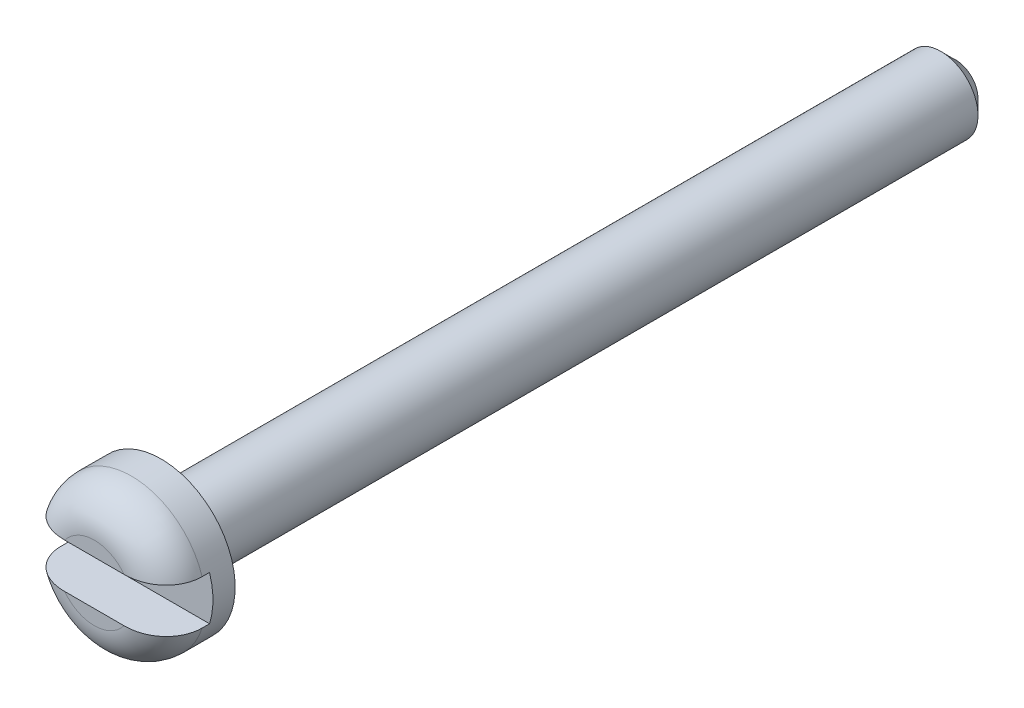
ISO-10303-21;
HEADER;
FILE_DESCRIPTION(('STEP AP214'),'2;1');
FILE_NAME('part.step','',(''),(''),'','','');
FILE_SCHEMA(('AUTOMOTIVE_DESIGN { 1 0 10303 214 1 1 1 1 }'));
ENDSEC;
DATA;
#1=APPLICATION_CONTEXT('core data for automotive mechanical design processes');
#2=APPLICATION_PROTOCOL_DEFINITION('international standard','automotive_design',2000,#1);
#3=PRODUCT_CONTEXT('',#1,'mechanical');
#4=PRODUCT('Part','Part','',(#3));
#5=PRODUCT_RELATED_PRODUCT_CATEGORY('part','',(#4));
#6=PRODUCT_DEFINITION_FORMATION('','',#4);
#7=PRODUCT_DEFINITION_CONTEXT('part definition',#1,'design');
#8=PRODUCT_DEFINITION('design','',#6,#7);
#9=PRODUCT_DEFINITION_SHAPE('','',#8);
#10=(LENGTH_UNIT() NAMED_UNIT(*) SI_UNIT(.MILLI.,.METRE.));
#11=(NAMED_UNIT(*) PLANE_ANGLE_UNIT() SI_UNIT($,.RADIAN.));
#12=(NAMED_UNIT(*) SI_UNIT($,.STERADIAN.) SOLID_ANGLE_UNIT());
#13=UNCERTAINTY_MEASURE_WITH_UNIT(LENGTH_MEASURE(1.E-05),#10,'distance_accuracy_value','');
#14=(GEOMETRIC_REPRESENTATION_CONTEXT(3) GLOBAL_UNCERTAINTY_ASSIGNED_CONTEXT((#13)) GLOBAL_UNIT_ASSIGNED_CONTEXT((#10,
#11,#12)) REPRESENTATION_CONTEXT('',''));
#15=CARTESIAN_POINT('',(0.,0.,0.));
#16=DIRECTION('',(0.,0.,1.));
#17=DIRECTION('',(1.,0.,0.));
#18=AXIS2_PLACEMENT_3D('',#15,#16,#17);
#19=CARTESIAN_POINT('',(0.,0.,0.));
#20=DIRECTION('',(0.,0.,1.));
#21=DIRECTION('',(1.,0.,0.));
#22=AXIS2_PLACEMENT_3D('',#19,#20,#21);
#23=PLANE('',#22);
#24=DIRECTION('',(1.,0.,0.));
#25=VECTOR('',#24,1.);
#26=CARTESIAN_POINT('',(-2.,-0.600000000000003,1.59594559789866E-13));
#27=LINE('',#26,#25);
#28=CARTESIAN_POINT('',(-0.799999999999995,-0.600000000000003,0.));
#29=VERTEX_POINT('',#28);
#30=CARTESIAN_POINT('',(0.799999999999995,-0.600000000000003,1.59594559789866E-13));
#31=VERTEX_POINT('',#30);
#32=EDGE_CURVE('E136',#29,#31,#27,.T.);
#33=ORIENTED_EDGE('',*,*,#32,.F.);
#34=CARTESIAN_POINT('',(0.,0.,0.));
#35=DIRECTION('',(0.,0.,1.));
#36=DIRECTION('',(1.,0.,0.));
#37=AXIS2_PLACEMENT_3D('',#34,#35,#36);
#38=CIRCLE('',#37,1.);
#39=EDGE_CURVE('E152',#29,#31,#38,.T.);
#40=ORIENTED_EDGE('',*,*,#39,.T.);
#41=EDGE_LOOP('',(#33,#40));
#42=FACE_BOUND('',#41,.T.);
#43=ADVANCED_FACE('F46',(#42),#23,.T.);
#44=DIRECTION('',(1.,0.,0.));
#45=VECTOR('',#44,1.);
#46=CARTESIAN_POINT('',(-2.,0.600000000000003,0.));
#47=LINE('',#46,#45);
#48=CARTESIAN_POINT('',(-0.799999999999995,0.600000000000003,1.59594559789866E-13));
#49=VERTEX_POINT('',#48);
#50=CARTESIAN_POINT('',(0.799999999999995,0.600000000000003,4.09394740330526E-13));
#51=VERTEX_POINT('',#50);
#52=EDGE_CURVE('E118',#49,#51,#47,.T.);
#53=ORIENTED_EDGE('',*,*,#52,.T.);
#54=CARTESIAN_POINT('',(0.,0.,0.));
#55=DIRECTION('',(0.,0.,1.));
#56=DIRECTION('',(1.,0.,0.));
#57=AXIS2_PLACEMENT_3D('',#54,#55,#56);
#58=CIRCLE('',#57,1.);
#59=EDGE_CURVE('E67',#51,#49,#58,.T.);
#60=ORIENTED_EDGE('',*,*,#59,.T.);
#61=EDGE_LOOP('',(#53,#60));
#62=FACE_BOUND('',#61,.T.);
#63=ADVANCED_FACE('F200',(#62),#23,.T.);
#64=CARTESIAN_POINT('',(0.,0.,-23.25));
#65=DIRECTION('',(0.,0.,-1.));
#66=DIRECTION('',(-1.,0.,0.));
#67=AXIS2_PLACEMENT_3D('',#64,#65,#66);
#68=CYLINDRICAL_SURFACE('',#67,2.);
#69=DIRECTION('',(0.,0.,-1.));
#70=VECTOR('',#69,1.);
#71=CARTESIAN_POINT('',(1.90787840283389,-0.600000000000003,-23.2499999999998));
#72=LINE('',#71,#70);
#73=CARTESIAN_POINT('',(1.90787840283396,-0.599999999999878,-0.999999999999841));
#74=VERTEX_POINT('',#73);
#75=CARTESIAN_POINT('',(1.90787840283489,-0.599999999999004,-1.19999999999984));
#76=VERTEX_POINT('',#75);
#77=EDGE_CURVE('E109',#74,#76,#72,.T.);
#78=ORIENTED_EDGE('',*,*,#77,.F.);
#79=CARTESIAN_POINT('',(0.,0.,-1.));
#80=DIRECTION('',(0.,0.,1.));
#81=DIRECTION('',(1.,0.,0.));
#82=AXIS2_PLACEMENT_3D('',#79,#80,#81);
#83=CIRCLE('',#82,2.);
#84=CARTESIAN_POINT('',(-1.90787840283382,-0.599999999999878,-0.999999999999682));
#85=VERTEX_POINT('',#84);
#86=EDGE_CURVE('E153',#74,#85,#83,.F.);
#87=ORIENTED_EDGE('',*,*,#86,.T.);
#88=DIRECTION('',(0.,0.,-1.));
#89=VECTOR('',#88,1.);
#90=CARTESIAN_POINT('',(-1.90787840283389,-0.600000000000003,-23.2499999999998));
#91=LINE('',#90,#89);
#92=CARTESIAN_POINT('',(-1.90787840283289,-0.599999999999004,-1.19999999999968));
#93=VERTEX_POINT('',#92);
#94=EDGE_CURVE('E126',#93,#85,#91,.F.);
#95=ORIENTED_EDGE('',*,*,#94,.F.);
#96=CARTESIAN_POINT('',(9.99200722162641E-13,9.99200722162641E-13,-1.2));
#97=DIRECTION('',(0.,0.,-1.));
#98=DIRECTION('',(-1.,0.,0.));
#99=AXIS2_PLACEMENT_3D('',#96,#97,#98);
#100=CIRCLE('',#99,2.);
#101=CARTESIAN_POINT('',(-1.90787840283289,0.600000000000989,-1.19999999999984));
#102=VERTEX_POINT('',#101);
#103=EDGE_CURVE('E110',#102,#93,#100,.F.);
#104=ORIENTED_EDGE('',*,*,#103,.F.);
#105=DIRECTION('',(0.,0.,-1.));
#106=VECTOR('',#105,1.);
#107=CARTESIAN_POINT('',(-1.90787840283389,0.600000000000003,-23.2500000000002));
#108=LINE('',#107,#106);
#109=CARTESIAN_POINT('',(-1.90787840283382,0.600000000000128,-0.999999999999841));
#110=VERTEX_POINT('',#109);
#111=EDGE_CURVE('E98',#110,#102,#108,.T.);
#112=ORIENTED_EDGE('',*,*,#111,.F.);
#113=CARTESIAN_POINT('',(0.,0.,-1.));
#114=DIRECTION('',(0.,0.,1.));
#115=DIRECTION('',(1.,0.,0.));
#116=AXIS2_PLACEMENT_3D('',#113,#114,#115);
#117=CIRCLE('',#116,2.);
#118=CARTESIAN_POINT('',(1.90787840283396,0.600000000000128,-1.));
#119=VERTEX_POINT('',#118);
#120=EDGE_CURVE('E156',#110,#119,#117,.F.);
#121=ORIENTED_EDGE('',*,*,#120,.T.);
#122=DIRECTION('',(0.,0.,-1.));
#123=VECTOR('',#122,1.);
#124=CARTESIAN_POINT('',(1.90787840283389,0.600000000000003,-23.2500000000002));
#125=LINE('',#124,#123);
#126=CARTESIAN_POINT('',(1.90787840283489,0.600000000000989,-1.2));
#127=VERTEX_POINT('',#126);
#128=EDGE_CURVE('E127',#127,#119,#125,.F.);
#129=ORIENTED_EDGE('',*,*,#128,.F.);
#130=EDGE_CURVE('E117',#76,#127,#100,.F.);
#131=ORIENTED_EDGE('',*,*,#130,.F.);
#132=EDGE_LOOP('',(#78,#87,#95,#104,#112,#121,#129,#131));
#133=FACE_BOUND('',#132,.T.);
#134=CARTESIAN_POINT('',(9.99200722162641E-13,9.99200722162641E-13,-1.8));
#135=DIRECTION('',(0.,0.,-1.));
#136=DIRECTION('',(-1.,0.,0.));
#137=AXIS2_PLACEMENT_3D('',#134,#135,#136);
#138=CIRCLE('',#137,2.);
#139=CARTESIAN_POINT('',(-1.999999999999,9.99200722162641E-13,-1.8));
#140=VERTEX_POINT('',#139);
#141=EDGE_CURVE('E131',#140,#140,#138,.T.);
#142=ORIENTED_EDGE('',*,*,#141,.F.);
#143=EDGE_LOOP('',(#142));
#144=FACE_BOUND('',#143,.T.);
#145=ADVANCED_FACE('F122',(#133,#144),#68,.T.);
#146=CARTESIAN_POINT('',(-1.999999999999,9.99200722162641E-13,-1.8));
#147=DIRECTION('',(0.,0.,-1.));
#148=DIRECTION('',(-1.,0.,0.));
#149=AXIS2_PLACEMENT_3D('',#146,#147,#148);
#150=PLANE('',#149);
#151=CARTESIAN_POINT('',(9.99200722162641E-13,9.99200722162641E-13,-1.8));
#152=DIRECTION('',(0.,0.,-1.));
#153=DIRECTION('',(-1.,0.,0.));
#154=AXIS2_PLACEMENT_3D('',#151,#152,#153);
#155=CIRCLE('',#154,1.4);
#156=CARTESIAN_POINT('',(-1.399999999999,9.99200722162641E-13,-1.8));
#157=VERTEX_POINT('',#156);
#158=EDGE_CURVE('E13',#157,#157,#155,.F.);
#159=ORIENTED_EDGE('',*,*,#158,.T.);
#160=EDGE_LOOP('',(#159));
#161=FACE_BOUND('',#160,.T.);
#162=ORIENTED_EDGE('',*,*,#141,.T.);
#163=EDGE_LOOP('',(#162));
#164=FACE_BOUND('',#163,.T.);
#165=ADVANCED_FACE('F231',(#161,#164),#150,.T.);
#166=CARTESIAN_POINT('',(0.,0.,-23.25));
#167=DIRECTION('',(0.,0.,-1.));
#168=DIRECTION('',(-1.,0.,0.));
#169=AXIS2_PLACEMENT_3D('',#166,#167,#168);
#170=CYLINDRICAL_SURFACE('',#169,1.);
#171=CARTESIAN_POINT('',(7.07767178198537E-13,6.38378239159465E-13,-2.2));
#172=DIRECTION('',(0.,0.,-1.));
#173=DIRECTION('',(-1.,0.,0.));
#174=AXIS2_PLACEMENT_3D('',#171,#172,#173);
#175=CIRCLE('',#174,1.);
#176=CARTESIAN_POINT('',(-0.999999999999292,6.38378239159465E-13,-2.2));
#177=VERTEX_POINT('',#176);
#178=EDGE_CURVE('E54',#177,#177,#175,.T.);
#179=ORIENTED_EDGE('',*,*,#178,.T.);
#180=EDGE_LOOP('',(#179));
#181=FACE_BOUND('',#180,.T.);
#182=CARTESIAN_POINT('',(7.07767178198537E-13,6.38378239159465E-13,-22.8499999999997));
#183=DIRECTION('',(0.,0.,-1.));
#184=DIRECTION('',(-1.,0.,0.));
#185=AXIS2_PLACEMENT_3D('',#182,#183,#184);
#186=CIRCLE('',#185,1.);
#187=CARTESIAN_POINT('',(-0.999999999999292,6.38378239159465E-13,-22.8499999999997));
#188=VERTEX_POINT('',#187);
#189=EDGE_CURVE('E214',#188,#188,#186,.F.);
#190=ORIENTED_EDGE('',*,*,#189,.T.);
#191=EDGE_LOOP('',(#190));
#192=FACE_BOUND('',#191,.T.);
#193=ADVANCED_FACE('F226',(#181,#192),#170,.T.);
#194=CARTESIAN_POINT('',(-1.,0.,-23.25));
#195=DIRECTION('',(0.,0.,-1.));
#196=DIRECTION('',(-1.,0.,0.));
#197=AXIS2_PLACEMENT_3D('',#194,#195,#196);
#198=PLANE('',#197);
#199=CARTESIAN_POINT('',(0.,0.,-23.25));
#200=DIRECTION('',(0.,0.,-1.));
#201=DIRECTION('',(-1.,0.,0.));
#202=AXIS2_PLACEMENT_3D('',#199,#200,#201);
#203=CIRCLE('',#202,0.599999999999993);
#204=CARTESIAN_POINT('',(-0.599999999999993,0.,-23.25));
#205=VERTEX_POINT('',#204);
#206=EDGE_CURVE('E217',#205,#205,#203,.T.);
#207=ORIENTED_EDGE('',*,*,#206,.T.);
#208=EDGE_LOOP('',(#207));
#209=FACE_BOUND('',#208,.T.);
#210=ADVANCED_FACE('F230',(#209),#198,.T.);
#211=CARTESIAN_POINT('',(-1.999999999999,0.600000000000989,-1.20000000000009));
#212=DIRECTION('',(0.,0.,-1.));
#213=DIRECTION('',(-1.,0.,0.));
#214=AXIS2_PLACEMENT_3D('',#211,#212,#213);
#215=PLANE('',#214);
#216=DIRECTION('',(1.,0.,0.));
#217=VECTOR('',#216,1.);
#218=CARTESIAN_POINT('',(-1.999999999999,-0.599999999999004,-1.19999999999984));
#219=LINE('',#218,#217);
#220=EDGE_CURVE('E133',#93,#76,#219,.T.);
#221=ORIENTED_EDGE('',*,*,#220,.T.);
#222=ORIENTED_EDGE('',*,*,#130,.T.);
#223=DIRECTION('',(1.,0.,0.));
#224=VECTOR('',#223,1.);
#225=CARTESIAN_POINT('',(-1.999999999999,0.600000000000989,-1.20000000000009));
#226=LINE('',#225,#224);
#227=EDGE_CURVE('E101',#102,#127,#226,.T.);
#228=ORIENTED_EDGE('',*,*,#227,.F.);
#229=ORIENTED_EDGE('',*,*,#103,.T.);
#230=EDGE_LOOP('',(#221,#222,#228,#229));
#231=FACE_BOUND('',#230,.T.);
#232=ADVANCED_FACE('F114',(#231),#215,.F.);
#233=CARTESIAN_POINT('',(-2.,-0.600000000000003,1.59594559789866E-13));
#234=DIRECTION('',(0.,-1.,0.));
#235=DIRECTION('',(0.,0.,-1.));
#236=AXIS2_PLACEMENT_3D('',#233,#234,#235);
#237=PLANE('',#236);
#238=ORIENTED_EDGE('',*,*,#94,.T.);
#239=CARTESIAN_POINT('',(-1.90787840283382,-0.599999999999878,-0.999999999999682));
#240=CARTESIAN_POINT('',(-1.90787854907982,-0.599999999999919,-0.972959130771294));
#241=CARTESIAN_POINT('',(-1.90672787533785,-0.599999999999972,-0.94593139358509));
#242=CARTESIAN_POINT('',(-1.90213965871632,-0.600000000000035,-0.892073352579339));
#243=CARTESIAN_POINT('',(-1.89870233629077,-0.600000000000046,-0.865243029979296));
#244=CARTESIAN_POINT('',(-1.88500553439193,-0.599999999999918,-0.785432939642471));
#245=CARTESIAN_POINT('',(-1.87136104202472,-0.59999999999962,-0.732994457844647));
#246=CARTESIAN_POINT('',(-1.83547723787554,-0.599999999999665,-0.631166383290926));
#247=CARTESIAN_POINT('',(-1.81323587663699,-0.600000000000008,-0.581777520809696));
#248=CARTESIAN_POINT('',(-1.76086428746495,-0.599999999999999,-0.487366203130628));
#249=CARTESIAN_POINT('',(-1.73073279715989,-0.599999999999646,-0.4423444482239));
#250=CARTESIAN_POINT('',(-1.66312688530866,-0.599999999999639,-0.357337576737513));
#251=CARTESIAN_POINT('',(-1.62557004752251,-0.599999999999994,-0.317418129279711));
#252=CARTESIAN_POINT('',(-1.54452503832062,-0.600000000000013,-0.244192208615991));
#253=CARTESIAN_POINT('',(-1.50103871840743,-0.599999999999677,-0.210883679067791));
#254=CARTESIAN_POINT('',(-1.40764162770742,-0.599999999999607,-0.150349512325555));
#255=CARTESIAN_POINT('',(-1.35754855323414,-0.599999999999897,-0.123405812779787));
#256=CARTESIAN_POINT('',(-1.25373724805445,-0.60000000000011,-0.0775813762052803));
#257=CARTESIAN_POINT('',(-1.20001320021332,-0.600000000000032,-0.0587139504691497));
#258=CARTESIAN_POINT('',(-1.08894741476528,-0.599999999999974,-0.0285839743219372));
#259=CARTESIAN_POINT('',(-1.03154740702987,-0.599999999999997,-0.0175376622486258));
#260=CARTESIAN_POINT('',(-0.94489821676316,-0.600000000000006,-0.00681830415336637));
#261=CARTESIAN_POINT('',(-0.915969059992475,-0.600000000000005,-0.00421972325925855));
#262=CARTESIAN_POINT('',(-0.858026852466932,-0.600000000000002,-0.000809343249865601));
#263=CARTESIAN_POINT('',(-0.829013885533513,-0.6,3.85878694093218E-06));
#264=CARTESIAN_POINT('',(-0.799999999999995,-0.600000000000003,0.));
#265=B_SPLINE_CURVE_WITH_KNOTS('',3,(#239,#240,#241,#242,#243,#244,#245,#246,#247,#248,#249,
#250,#251,#252,#253,#254,#255,#256,#257,#258,#259,#260,#261,#262,#263,#264),.UNSPECIFIED.,.F.,
.F.,(4,2,2,2,2,2,2,2,2,2,2,2,4),(0.,0.0810721414035933,0.162136467837825,0.323851745437087,
0.485605599064571,0.647385348131914,0.811073248357429,0.97471015298731,1.14461630154626,
1.31480142065021,1.48952530024634,1.57661664192104,1.66363952411284),.UNSPECIFIED.);
#266=EDGE_CURVE('E146',#85,#29,#265,.T.);
#267=ORIENTED_EDGE('',*,*,#266,.T.);
#268=ORIENTED_EDGE('',*,*,#32,.T.);
#269=CARTESIAN_POINT('',(0.799999999999995,-0.600000000000003,1.59594559789866E-13));
#270=CARTESIAN_POINT('',(0.838394836130345,-0.600000000000004,1.99528028006428E-05));
#271=CARTESIAN_POINT('',(0.876818260827927,-0.600000000000004,-0.00141609976622913));
#272=CARTESIAN_POINT('',(0.953479794413799,-0.600000000000003,-0.00749671073620861));
#273=CARTESIAN_POINT('',(0.991717409766045,-0.600000000000002,-0.0121473864561534));
#274=CARTESIAN_POINT('',(1.06772952552835,-0.600000000000004,-0.0249752264161925));
#275=CARTESIAN_POINT('',(1.10550229626654,-0.600000000000007,-0.0331629090048385));
#276=CARTESIAN_POINT('',(1.18002220545578,-0.599999999999999,-0.0532083718127339));
#277=CARTESIAN_POINT('',(1.21677020491699,-0.599999999999989,-0.0650629632106972));
#278=CARTESIAN_POINT('',(1.30802367231537,-0.600000000000026,-0.0998313714612307));
#279=CARTESIAN_POINT('',(1.36159604248346,-0.600000000000107,-0.125275046228714));
#280=CARTESIAN_POINT('',(1.46361714671403,-0.5999999999999,-0.184704245017816));
#281=CARTESIAN_POINT('',(1.51207733492208,-0.599999999999614,-0.218670071300634));
#282=CARTESIAN_POINT('',(1.60255973623117,-0.599999999999671,-0.294632564888537));
#283=CARTESIAN_POINT('',(1.64455838328626,-0.600000000000016,-0.336657429054003));
#284=CARTESIAN_POINT('',(1.72041826417247,-0.59999999999999,-0.42758102537807));
#285=CARTESIAN_POINT('',(1.75427320042028,-0.599999999999618,-0.476485031205134));
#286=CARTESIAN_POINT('',(1.81087578852493,-0.599999999999665,-0.576693751794179));
#287=CARTESIAN_POINT('',(1.83414423155858,-0.600000000000041,-0.627705291455605));
#288=CARTESIAN_POINT('',(1.87145598656548,-0.599999999999965,-0.732953582700348));
#289=CARTESIAN_POINT('',(1.88551296563697,-0.599999999999515,-0.787185425311159));
#290=CARTESIAN_POINT('',(1.89911123482794,-0.599999999999703,-0.868258802742019));
#291=CARTESIAN_POINT('',(1.90239870195701,-0.599999999999894,-0.894520196980939));
#292=CARTESIAN_POINT('',(1.9067803602152,-0.600000000000113,-0.947183375692285));
#293=CARTESIAN_POINT('',(1.90787802286911,-0.600000000000141,-0.973584871319036));
#294=CARTESIAN_POINT('',(1.90787840283396,-0.599999999999878,-0.999999999999841));
#295=B_SPLINE_CURVE_WITH_KNOTS('',3,(#269,#270,#271,#272,#273,#274,#275,#276,#277,#278,#279,
#280,#281,#282,#283,#284,#285,#286,#287,#288,#289,#290,#291,#292,#293,#294),.UNSPECIFIED.,.F.,
.F.,(4,2,2,2,2,2,2,2,2,2,2,2,4),(0.,0.115198607746711,0.23061704025184,0.346381092640429,
0.462044755850758,0.639130233485499,0.815810114307567,0.99311982695327,1.1705662166792,
1.33795510555169,1.50509507290818,1.58441647905367,1.66361203572307),.UNSPECIFIED.);
#296=EDGE_CURVE('E145',#31,#74,#295,.T.);
#297=ORIENTED_EDGE('',*,*,#296,.T.);
#298=ORIENTED_EDGE('',*,*,#77,.T.);
#299=ORIENTED_EDGE('',*,*,#220,.F.);
#300=EDGE_LOOP('',(#238,#267,#268,#297,#298,#299));
#301=FACE_BOUND('',#300,.T.);
#302=ADVANCED_FACE('F144',(#301),#237,.F.);
#303=CARTESIAN_POINT('',(-2.,0.600000000000003,0.));
#304=DIRECTION('',(0.,1.,0.));
#305=DIRECTION('',(0.,0.,1.));
#306=AXIS2_PLACEMENT_3D('',#303,#304,#305);
#307=PLANE('',#306);
#308=ORIENTED_EDGE('',*,*,#128,.T.);
#309=CARTESIAN_POINT('',(1.90787840283396,0.600000000000128,-1.));
#310=CARTESIAN_POINT('',(1.90787854907995,0.600000000000088,-0.97295913077156));
#311=CARTESIAN_POINT('',(1.90672787533792,0.600000000000035,-0.945931393585335));
#312=CARTESIAN_POINT('',(1.90213965871629,0.599999999999972,-0.892073352579483));
#313=CARTESIAN_POINT('',(1.89870233629071,0.599999999999961,-0.86524302997936));
#314=CARTESIAN_POINT('',(1.88500553439205,0.600000000000088,-0.785432939642285));
#315=CARTESIAN_POINT('',(1.87136104202537,0.600000000000387,-0.73299445784419));
#316=CARTESIAN_POINT('',(1.83547723787612,0.600000000000342,-0.631166383290538));
#317=CARTESIAN_POINT('',(1.81323587663699,0.599999999999999,-0.581777520809641));
#318=CARTESIAN_POINT('',(1.76086428746491,0.600000000000008,-0.487366203130614));
#319=CARTESIAN_POINT('',(1.73073279716038,0.600000000000361,-0.442344448223595));
#320=CARTESIAN_POINT('',(1.66312688530928,0.600000000000367,-0.35733757673729));
#321=CARTESIAN_POINT('',(1.62557004752273,0.600000000000013,-0.317418129279875));
#322=CARTESIAN_POINT('',(1.54452503832077,0.599999999999994,-0.24419220861616));
#323=CARTESIAN_POINT('',(1.50103871840793,0.60000000000033,-0.210883679067575));
#324=CARTESIAN_POINT('',(1.40764162770803,0.6000000000004,-0.150349512325232));
#325=CARTESIAN_POINT('',(1.35754855323448,0.60000000000011,-0.123405812779778));
#326=CARTESIAN_POINT('',(1.25373724805451,0.599999999999897,-0.0775813762054647));
#327=CARTESIAN_POINT('',(1.20001320021337,0.599999999999975,-0.0587139504692136));
#328=CARTESIAN_POINT('',(1.08894741476528,0.600000000000032,-0.028583974321885));
#329=CARTESIAN_POINT('',(1.03154740702983,0.600000000000009,-0.0175376622485734));
#330=CARTESIAN_POINT('',(0.944898216763083,0.6,-0.00681830415337983));
#331=CARTESIAN_POINT('',(0.915969059992402,0.600000000000002,-0.00421972325930482));
#332=CARTESIAN_POINT('',(0.858026852466886,0.600000000000005,-0.000809343249812091));
#333=CARTESIAN_POINT('',(0.829013885533488,0.600000000000006,3.8587871277182E-06));
#334=CARTESIAN_POINT('',(0.799999999999995,0.600000000000003,4.05925293378573E-13));
#335=B_SPLINE_CURVE_WITH_KNOTS('',3,(#309,#310,#311,#312,#313,#314,#315,#316,#317,#318,#319,
#320,#321,#322,#323,#324,#325,#326,#327,#328,#329,#330,#331,#332,#333,#334),.UNSPECIFIED.,.F.,
.F.,(4,2,2,2,2,2,2,2,2,2,2,2,4),(0.,0.0810721414036954,0.162136467838197,0.323851745437745,
0.485605599065048,0.64738534813225,0.811073248357733,0.974710152987541,1.14461630154666,
1.31480142065084,1.48952530024705,1.57661664192173,1.66363952411348),.UNSPECIFIED.);
#336=EDGE_CURVE('E61',#119,#51,#335,.T.);
#337=ORIENTED_EDGE('',*,*,#336,.T.);
#338=ORIENTED_EDGE('',*,*,#52,.F.);
#339=CARTESIAN_POINT('',(-0.799999999999995,0.600000000000003,1.59594559789866E-13));
#340=CARTESIAN_POINT('',(-0.838394836130337,0.600000000000002,1.99528027870605E-05));
#341=CARTESIAN_POINT('',(-0.876818260827917,0.600000000000003,-0.00141609976623567));
#342=CARTESIAN_POINT('',(-0.9534797944138,0.600000000000004,-0.00749671073620146));
#343=CARTESIAN_POINT('',(-0.991717409766059,0.600000000000004,-0.0121473864561408));
#344=CARTESIAN_POINT('',(-1.06772952552835,0.600000000000002,-0.0249752264162078));
#345=CARTESIAN_POINT('',(-1.10550229626652,0.599999999999999,-0.0331629090048853));
#346=CARTESIAN_POINT('',(-1.18002220545576,0.600000000000007,-0.0532083718126744));
#347=CARTESIAN_POINT('',(-1.216770204917,0.600000000000018,-0.0650629632104995));
#348=CARTESIAN_POINT('',(-1.30802367231531,0.599999999999981,-0.0998313714608876));
#349=CARTESIAN_POINT('',(-1.36159604248327,0.5999999999999,-0.125275046228475));
#350=CARTESIAN_POINT('',(-1.46361714671357,0.600000000000106,-0.184704245017679));
#351=CARTESIAN_POINT('',(-1.51207733492149,0.600000000000393,-0.218670071300498));
#352=CARTESIAN_POINT('',(-1.6025597362307,0.600000000000336,-0.294632564888256));
#353=CARTESIAN_POINT('',(-1.64455838328603,0.59999999999999,-0.336657429053592));
#354=CARTESIAN_POINT('',(-1.72041826417212,0.600000000000016,-0.427581025377783));
#355=CARTESIAN_POINT('',(-1.75427320041959,0.600000000000389,-0.4764850312051));
#356=CARTESIAN_POINT('',(-1.81087578852444,0.600000000000341,-0.576693751794184));
#357=CARTESIAN_POINT('',(-1.83414423155858,0.599999999999965,-0.627705291455416));
#358=CARTESIAN_POINT('',(-1.87145598656534,0.600000000000041,-0.732953582700149));
#359=CARTESIAN_POINT('',(-1.88551296563619,0.600000000000492,-0.787185425311142));
#360=CARTESIAN_POINT('',(-1.89911123482748,0.600000000000304,-0.868258802742029));
#361=CARTESIAN_POINT('',(-1.90239870195683,0.600000000000113,-0.894520196980922));
#362=CARTESIAN_POINT('',(-1.90678036021537,0.599999999999894,-0.947183375692235));
#363=CARTESIAN_POINT('',(-1.90787802286934,0.599999999999865,-0.973584871318979));
#364=CARTESIAN_POINT('',(-1.90787840283382,0.600000000000128,-0.999999999999841));
#365=B_SPLINE_CURVE_WITH_KNOTS('',3,(#339,#340,#341,#342,#343,#344,#345,#346,#347,#348,#349,
#350,#351,#352,#353,#354,#355,#356,#357,#358,#359,#360,#361,#362,#363,#364),.UNSPECIFIED.,.F.,
.F.,(4,2,2,2,2,2,2,2,2,2,2,2,4),(0.,0.1151986077467,0.230617040251859,0.346381092640408,
0.462044755850682,0.639130233485152,0.815810114306976,0.993119826952819,1.17056621667886,
1.33795510555139,1.50509507290794,1.58441647905347,1.6636120357229),.UNSPECIFIED.);
#366=EDGE_CURVE('E104',#49,#110,#365,.T.);
#367=ORIENTED_EDGE('',*,*,#366,.T.);
#368=ORIENTED_EDGE('',*,*,#111,.T.);
#369=ORIENTED_EDGE('',*,*,#227,.T.);
#370=EDGE_LOOP('',(#308,#337,#338,#367,#368,#369));
#371=FACE_BOUND('',#370,.T.);
#372=ADVANCED_FACE('F100',(#371),#307,.F.);
#373=CARTESIAN_POINT('',(0.,0.,-23.25));
#374=DIRECTION('',(0.,0.,1.));
#375=DIRECTION('',(1.,0.,0.));
#376=AXIS2_PLACEMENT_3D('',#373,#374,#375);
#377=CONICAL_SURFACE('',#376,0.599999999999993,0.785398163397443);
#378=ORIENTED_EDGE('',*,*,#189,.F.);
#379=EDGE_LOOP('',(#378));
#380=FACE_BOUND('',#379,.T.);
#381=ORIENTED_EDGE('',*,*,#206,.F.);
#382=EDGE_LOOP('',(#381));
#383=FACE_BOUND('',#382,.T.);
#384=ADVANCED_FACE('F177',(#380,#383),#377,.T.);
#385=CARTESIAN_POINT('',(0.,0.,-1.));
#386=DIRECTION('',(0.,0.,1.));
#387=DIRECTION('',(1.,0.,0.));
#388=AXIS2_PLACEMENT_3D('',#385,#386,#387);
#389=DEGENERATE_TOROIDAL_SURFACE('',#388,1.,1.,.T.);
#390=ORIENTED_EDGE('',*,*,#296,.F.);
#391=ORIENTED_EDGE('',*,*,#39,.F.);
#392=ORIENTED_EDGE('',*,*,#266,.F.);
#393=ORIENTED_EDGE('',*,*,#86,.F.);
#394=EDGE_LOOP('',(#390,#391,#392,#393));
#395=FACE_BOUND('',#394,.T.);
#396=ADVANCED_FACE('F151',(#395),#389,.T.);
#397=CARTESIAN_POINT('',(0.,0.,-1.));
#398=DIRECTION('',(0.,0.,1.));
#399=DIRECTION('',(1.,0.,0.));
#400=AXIS2_PLACEMENT_3D('',#397,#398,#399);
#401=DEGENERATE_TOROIDAL_SURFACE('',#400,1.,1.,.T.);
#402=ORIENTED_EDGE('',*,*,#366,.F.);
#403=ORIENTED_EDGE('',*,*,#59,.F.);
#404=ORIENTED_EDGE('',*,*,#336,.F.);
#405=ORIENTED_EDGE('',*,*,#120,.F.);
#406=EDGE_LOOP('',(#402,#403,#404,#405));
#407=FACE_BOUND('',#406,.T.);
#408=ADVANCED_FACE('F189',(#407),#401,.T.);
#409=CARTESIAN_POINT('',(7.07767178198537E-13,6.38378239159465E-13,-2.2));
#410=DIRECTION('',(0.,0.,-1.));
#411=DIRECTION('',(-1.,0.,0.));
#412=AXIS2_PLACEMENT_3D('',#409,#410,#411);
#413=TOROIDAL_SURFACE('',#412,1.4,0.4);
#414=ORIENTED_EDGE('',*,*,#158,.F.);
#415=EDGE_LOOP('',(#414));
#416=FACE_BOUND('',#415,.T.);
#417=ORIENTED_EDGE('',*,*,#178,.F.);
#418=EDGE_LOOP('',(#417));
#419=FACE_BOUND('',#418,.T.);
#420=ADVANCED_FACE('F48',(#416,#419),#413,.F.);
#421=CLOSED_SHELL('',(#43,#63,#145,#165,#193,#210,#232,#302,#372,#384,#396,#408,#420));
#422=MANIFOLD_SOLID_BREP('B2',#421);
#423=ADVANCED_BREP_SHAPE_REPRESENTATION('',(#18,#422),#14);
#424=SHAPE_DEFINITION_REPRESENTATION(#9,#423);
ENDSEC;
END-ISO-10303-21;
